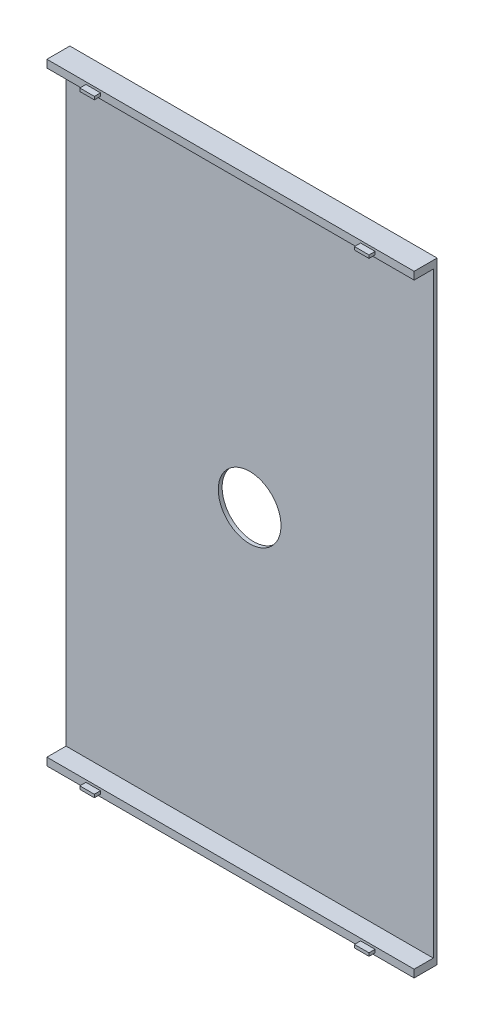
ISO-10303-21;
HEADER;
FILE_DESCRIPTION(('STEP AP214'),'2;1');
FILE_NAME('part.step','',(''),(''),'','','');
FILE_SCHEMA(('AUTOMOTIVE_DESIGN { 1 0 10303 214 1 1 1 1 }'));
ENDSEC;
DATA;
#1=APPLICATION_CONTEXT('core data for automotive mechanical design processes');
#2=APPLICATION_PROTOCOL_DEFINITION('international standard','automotive_design',2000,#1);
#3=PRODUCT_CONTEXT('',#1,'mechanical');
#4=PRODUCT('Part','Part','',(#3));
#5=PRODUCT_RELATED_PRODUCT_CATEGORY('part','',(#4));
#6=PRODUCT_DEFINITION_FORMATION('','',#4);
#7=PRODUCT_DEFINITION_CONTEXT('part definition',#1,'design');
#8=PRODUCT_DEFINITION('design','',#6,#7);
#9=PRODUCT_DEFINITION_SHAPE('','',#8);
#10=(LENGTH_UNIT() NAMED_UNIT(*) SI_UNIT(.MILLI.,.METRE.));
#11=(NAMED_UNIT(*) PLANE_ANGLE_UNIT() SI_UNIT($,.RADIAN.));
#12=(NAMED_UNIT(*) SI_UNIT($,.STERADIAN.) SOLID_ANGLE_UNIT());
#13=UNCERTAINTY_MEASURE_WITH_UNIT(LENGTH_MEASURE(1.E-05),#10,'distance_accuracy_value','');
#14=(GEOMETRIC_REPRESENTATION_CONTEXT(3) GLOBAL_UNCERTAINTY_ASSIGNED_CONTEXT((#13)) GLOBAL_UNIT_ASSIGNED_CONTEXT((#10,
#11,#12)) REPRESENTATION_CONTEXT('',''));
#15=CARTESIAN_POINT('',(0.,0.,0.));
#16=DIRECTION('',(0.,0.,1.));
#17=DIRECTION('',(1.,0.,0.));
#18=AXIS2_PLACEMENT_3D('',#15,#16,#17);
#19=CARTESIAN_POINT('',(0.,0.,3.));
#20=DIRECTION('',(0.,0.,1.));
#21=DIRECTION('',(1.,0.,0.));
#22=AXIS2_PLACEMENT_3D('',#19,#20,#21);
#23=PLANE('',#22);
#24=DIRECTION('',(0.,1.,0.));
#25=VECTOR('',#24,1.);
#26=CARTESIAN_POINT('',(48.,0.,3.));
#27=LINE('',#26,#25);
#28=CARTESIAN_POINT('',(48.,0.,3.));
#29=VERTEX_POINT('',#28);
#30=CARTESIAN_POINT('',(48.,1.,3.));
#31=VERTEX_POINT('',#30);
#32=EDGE_CURVE('E320',#29,#31,#27,.T.);
#33=ORIENTED_EDGE('',*,*,#32,.T.);
#34=DIRECTION('',(-1.,0.,0.));
#35=VECTOR('',#34,1.);
#36=CARTESIAN_POINT('',(48.,1.,3.));
#37=LINE('',#36,#35);
#38=CARTESIAN_POINT('',(0.,1.,3.));
#39=VERTEX_POINT('',#38);
#40=EDGE_CURVE('E323',#31,#39,#37,.T.);
#41=ORIENTED_EDGE('',*,*,#40,.T.);
#42=DIRECTION('',(0.,-1.,0.));
#43=VECTOR('',#42,1.);
#44=CARTESIAN_POINT('',(0.,1.,3.));
#45=LINE('',#44,#43);
#46=CARTESIAN_POINT('',(0.,0.,3.));
#47=VERTEX_POINT('',#46);
#48=EDGE_CURVE('E325',#39,#47,#45,.T.);
#49=ORIENTED_EDGE('',*,*,#48,.T.);
#50=DIRECTION('',(1.,0.,0.));
#51=VECTOR('',#50,1.);
#52=CARTESIAN_POINT('',(0.,0.,3.));
#53=LINE('',#52,#51);
#54=EDGE_CURVE('E328',#47,#29,#53,.T.);
#55=ORIENTED_EDGE('',*,*,#54,.T.);
#56=EDGE_LOOP('',(#33,#41,#49,#55));
#57=FACE_BOUND('',#56,.T.);
#58=DIRECTION('',(1.,0.,0.));
#59=VECTOR('',#58,1.);
#60=CARTESIAN_POINT('',(5.1,0.3,3.));
#61=LINE('',#60,#59);
#62=CARTESIAN_POINT('',(5.1,0.3,3.));
#63=VERTEX_POINT('',#62);
#64=CARTESIAN_POINT('',(7.,0.3,3.));
#65=VERTEX_POINT('',#64);
#66=EDGE_CURVE('E225',#63,#65,#61,.T.);
#67=ORIENTED_EDGE('',*,*,#66,.F.);
#68=DIRECTION('',(0.,-1.,0.));
#69=VECTOR('',#68,1.);
#70=CARTESIAN_POINT('',(5.1,0.700000000000002,3.));
#71=LINE('',#70,#69);
#72=CARTESIAN_POINT('',(5.1,0.700000000000002,3.));
#73=VERTEX_POINT('',#72);
#74=EDGE_CURVE('E222',#73,#63,#71,.T.);
#75=ORIENTED_EDGE('',*,*,#74,.F.);
#76=DIRECTION('',(-1.,0.,0.));
#77=VECTOR('',#76,1.);
#78=CARTESIAN_POINT('',(5.1,0.700000000000002,3.));
#79=LINE('',#78,#77);
#80=CARTESIAN_POINT('',(7.,0.700000000000003,3.));
#81=VERTEX_POINT('',#80);
#82=EDGE_CURVE('E234',#81,#73,#79,.T.);
#83=ORIENTED_EDGE('',*,*,#82,.F.);
#84=DIRECTION('',(0.,1.,0.));
#85=VECTOR('',#84,1.);
#86=CARTESIAN_POINT('',(7.,0.700000000000003,3.));
#87=LINE('',#86,#85);
#88=EDGE_CURVE('E242',#65,#81,#87,.T.);
#89=ORIENTED_EDGE('',*,*,#88,.F.);
#90=EDGE_LOOP('',(#67,#75,#83,#89));
#91=FACE_BOUND('',#90,.T.);
#92=DIRECTION('',(-1.,0.,0.));
#93=VECTOR('',#92,1.);
#94=CARTESIAN_POINT('',(42.9,0.700000000000011,3.));
#95=LINE('',#94,#93);
#96=CARTESIAN_POINT('',(42.9,0.700000000000011,3.));
#97=VERTEX_POINT('',#96);
#98=CARTESIAN_POINT('',(41.,0.700000000000019,3.));
#99=VERTEX_POINT('',#98);
#100=EDGE_CURVE('E728',#97,#99,#95,.T.);
#101=ORIENTED_EDGE('',*,*,#100,.F.);
#102=DIRECTION('',(0.,1.,0.));
#103=VECTOR('',#102,1.);
#104=CARTESIAN_POINT('',(42.9,0.700000000000011,3.));
#105=LINE('',#104,#103);
#106=CARTESIAN_POINT('',(42.9,0.300000000000005,3.));
#107=VERTEX_POINT('',#106);
#108=EDGE_CURVE('E220',#107,#97,#105,.T.);
#109=ORIENTED_EDGE('',*,*,#108,.F.);
#110=DIRECTION('',(1.,0.,0.));
#111=VECTOR('',#110,1.);
#112=CARTESIAN_POINT('',(42.9,0.300000000000005,3.));
#113=LINE('',#112,#111);
#114=CARTESIAN_POINT('',(41.,0.300000000000004,3.));
#115=VERTEX_POINT('',#114);
#116=EDGE_CURVE('E216',#115,#107,#113,.T.);
#117=ORIENTED_EDGE('',*,*,#116,.F.);
#118=DIRECTION('',(0.,-1.,0.));
#119=VECTOR('',#118,1.);
#120=CARTESIAN_POINT('',(41.,0.700000000000019,3.));
#121=LINE('',#120,#119);
#122=EDGE_CURVE('E730',#99,#115,#121,.T.);
#123=ORIENTED_EDGE('',*,*,#122,.F.);
#124=EDGE_LOOP('',(#101,#109,#117,#123));
#125=FACE_BOUND('',#124,.T.);
#126=ADVANCED_FACE('F35',(#57,#91,#125),#23,.T.);
#127=CARTESIAN_POINT('',(0.,0.,3.));
#128=DIRECTION('',(0.,0.,-1.));
#129=DIRECTION('',(-1.,0.,0.));
#130=AXIS2_PLACEMENT_3D('',#127,#128,#129);
#131=PLANE('',#130);
#132=DIRECTION('',(0.,-1.,0.));
#133=VECTOR('',#132,1.);
#134=CARTESIAN_POINT('',(5.1,79.7,3.));
#135=LINE('',#134,#133);
#136=CARTESIAN_POINT('',(5.1,79.7,3.));
#137=VERTEX_POINT('',#136);
#138=CARTESIAN_POINT('',(5.1,79.3,3.));
#139=VERTEX_POINT('',#138);
#140=EDGE_CURVE('E286',#137,#139,#135,.T.);
#141=ORIENTED_EDGE('',*,*,#140,.F.);
#142=DIRECTION('',(-1.,0.,0.));
#143=VECTOR('',#142,1.);
#144=CARTESIAN_POINT('',(5.1,79.7,3.));
#145=LINE('',#144,#143);
#146=CARTESIAN_POINT('',(7.,79.7,3.));
#147=VERTEX_POINT('',#146);
#148=EDGE_CURVE('E291',#147,#137,#145,.T.);
#149=ORIENTED_EDGE('',*,*,#148,.F.);
#150=DIRECTION('',(0.,1.,0.));
#151=VECTOR('',#150,1.);
#152=CARTESIAN_POINT('',(7.,79.7,3.));
#153=LINE('',#152,#151);
#154=CARTESIAN_POINT('',(7.,79.3,3.));
#155=VERTEX_POINT('',#154);
#156=EDGE_CURVE('E303',#155,#147,#153,.T.);
#157=ORIENTED_EDGE('',*,*,#156,.F.);
#158=DIRECTION('',(1.,0.,0.));
#159=VECTOR('',#158,1.);
#160=CARTESIAN_POINT('',(5.1,79.3,3.));
#161=LINE('',#160,#159);
#162=EDGE_CURVE('E300',#139,#155,#161,.T.);
#163=ORIENTED_EDGE('',*,*,#162,.F.);
#164=EDGE_LOOP('',(#141,#149,#157,#163));
#165=FACE_BOUND('',#164,.T.);
#166=DIRECTION('',(0.,-1.,0.));
#167=VECTOR('',#166,1.);
#168=CARTESIAN_POINT('',(0.,79.,3.));
#169=LINE('',#168,#167);
#170=CARTESIAN_POINT('',(0.,80.,3.));
#171=VERTEX_POINT('',#170);
#172=CARTESIAN_POINT('',(0.,79.,3.));
#173=VERTEX_POINT('',#172);
#174=EDGE_CURVE('E340',#171,#173,#169,.T.);
#175=ORIENTED_EDGE('',*,*,#174,.T.);
#176=DIRECTION('',(1.,0.,0.));
#177=VECTOR('',#176,1.);
#178=CARTESIAN_POINT('',(48.,79.,3.));
#179=LINE('',#178,#177);
#180=CARTESIAN_POINT('',(48.,79.,3.));
#181=VERTEX_POINT('',#180);
#182=EDGE_CURVE('E343',#173,#181,#179,.T.);
#183=ORIENTED_EDGE('',*,*,#182,.T.);
#184=DIRECTION('',(0.,1.,0.));
#185=VECTOR('',#184,1.);
#186=CARTESIAN_POINT('',(48.,80.,3.));
#187=LINE('',#186,#185);
#188=CARTESIAN_POINT('',(48.,80.,3.));
#189=VERTEX_POINT('',#188);
#190=EDGE_CURVE('E345',#181,#189,#187,.T.);
#191=ORIENTED_EDGE('',*,*,#190,.T.);
#192=DIRECTION('',(-1.,0.,0.));
#193=VECTOR('',#192,1.);
#194=CARTESIAN_POINT('',(0.,80.,3.));
#195=LINE('',#194,#193);
#196=EDGE_CURVE('E348',#189,#171,#195,.T.);
#197=ORIENTED_EDGE('',*,*,#196,.T.);
#198=EDGE_LOOP('',(#175,#183,#191,#197));
#199=FACE_BOUND('',#198,.T.);
#200=DIRECTION('',(0.,1.,0.));
#201=VECTOR('',#200,1.);
#202=CARTESIAN_POINT('',(42.9000000000001,79.7,3.));
#203=LINE('',#202,#201);
#204=CARTESIAN_POINT('',(42.9000000000001,79.3,3.));
#205=VERTEX_POINT('',#204);
#206=CARTESIAN_POINT('',(42.9000000000001,79.7,3.));
#207=VERTEX_POINT('',#206);
#208=EDGE_CURVE('E253',#205,#207,#203,.T.);
#209=ORIENTED_EDGE('',*,*,#208,.F.);
#210=DIRECTION('',(1.,0.,0.));
#211=VECTOR('',#210,1.);
#212=CARTESIAN_POINT('',(42.9000000000001,79.3,3.));
#213=LINE('',#212,#211);
#214=CARTESIAN_POINT('',(41.0000000000001,79.3,3.));
#215=VERTEX_POINT('',#214);
#216=EDGE_CURVE('E258',#215,#205,#213,.T.);
#217=ORIENTED_EDGE('',*,*,#216,.F.);
#218=DIRECTION('',(0.,-1.,0.));
#219=VECTOR('',#218,1.);
#220=CARTESIAN_POINT('',(41.0000000000001,79.7,3.));
#221=LINE('',#220,#219);
#222=CARTESIAN_POINT('',(41.0000000000001,79.7,3.));
#223=VERTEX_POINT('',#222);
#224=EDGE_CURVE('E270',#223,#215,#221,.T.);
#225=ORIENTED_EDGE('',*,*,#224,.F.);
#226=DIRECTION('',(-1.,0.,0.));
#227=VECTOR('',#226,1.);
#228=CARTESIAN_POINT('',(42.9000000000001,79.7,3.));
#229=LINE('',#228,#227);
#230=EDGE_CURVE('E267',#207,#223,#229,.T.);
#231=ORIENTED_EDGE('',*,*,#230,.F.);
#232=EDGE_LOOP('',(#209,#217,#225,#231));
#233=FACE_BOUND('',#232,.T.);
#234=ADVANCED_FACE('F397',(#165,#199,#233),#131,.F.);
#235=CARTESIAN_POINT('',(0.,0.,0.5));
#236=DIRECTION('',(0.,0.,1.));
#237=DIRECTION('',(1.,0.,0.));
#238=AXIS2_PLACEMENT_3D('',#235,#236,#237);
#239=PLANE('',#238);
#240=CARTESIAN_POINT('',(24.,40.,0.5));
#241=DIRECTION('',(0.,0.,-1.));
#242=DIRECTION('',(-1.,0.,0.));
#243=AXIS2_PLACEMENT_3D('',#240,#241,#242);
#244=CIRCLE('',#243,4.1);
#245=CARTESIAN_POINT('',(19.9,40.,0.5));
#246=VERTEX_POINT('',#245);
#247=EDGE_CURVE('E717',#246,#246,#244,.T.);
#248=ORIENTED_EDGE('',*,*,#247,.T.);
#249=EDGE_LOOP('',(#248));
#250=FACE_BOUND('',#249,.T.);
#251=DIRECTION('',(0.,-1.,0.));
#252=VECTOR('',#251,1.);
#253=CARTESIAN_POINT('',(0.,80.,0.5));
#254=LINE('',#253,#252);
#255=CARTESIAN_POINT('',(0.,79.,0.5));
#256=VERTEX_POINT('',#255);
#257=CARTESIAN_POINT('',(0.,1.,0.5));
#258=VERTEX_POINT('',#257);
#259=EDGE_CURVE('E360',#256,#258,#254,.T.);
#260=ORIENTED_EDGE('',*,*,#259,.T.);
#261=DIRECTION('',(-1.,0.,0.));
#262=VECTOR('',#261,1.);
#263=CARTESIAN_POINT('',(48.,1.,0.5));
#264=LINE('',#263,#262);
#265=CARTESIAN_POINT('',(48.,1.,0.5));
#266=VERTEX_POINT('',#265);
#267=EDGE_CURVE('E319',#266,#258,#264,.T.);
#268=ORIENTED_EDGE('',*,*,#267,.F.);
#269=DIRECTION('',(0.,1.,0.));
#270=VECTOR('',#269,1.);
#271=CARTESIAN_POINT('',(48.,0.,0.5));
#272=LINE('',#271,#270);
#273=CARTESIAN_POINT('',(48.,79.,0.5));
#274=VERTEX_POINT('',#273);
#275=EDGE_CURVE('E362',#266,#274,#272,.T.);
#276=ORIENTED_EDGE('',*,*,#275,.T.);
#277=DIRECTION('',(1.,0.,0.));
#278=VECTOR('',#277,1.);
#279=CARTESIAN_POINT('',(48.,79.,0.5));
#280=LINE('',#279,#278);
#281=EDGE_CURVE('E339',#256,#274,#280,.T.);
#282=ORIENTED_EDGE('',*,*,#281,.F.);
#283=EDGE_LOOP('',(#260,#268,#276,#282));
#284=FACE_BOUND('',#283,.T.);
#285=ADVANCED_FACE('F405',(#250,#284),#239,.T.);
#286=CARTESIAN_POINT('',(0.,80.,0.5));
#287=DIRECTION('',(1.,0.,0.));
#288=DIRECTION('',(0.,1.,0.));
#289=AXIS2_PLACEMENT_3D('',#286,#287,#288);
#290=PLANE('',#289);
#291=DIRECTION('',(0.,-1.,0.));
#292=VECTOR('',#291,1.);
#293=CARTESIAN_POINT('',(0.,80.,0.));
#294=LINE('',#293,#292);
#295=CARTESIAN_POINT('',(0.,80.,0.));
#296=VERTEX_POINT('',#295);
#297=CARTESIAN_POINT('',(0.,0.,0.));
#298=VERTEX_POINT('',#297);
#299=EDGE_CURVE('E359',#296,#298,#294,.T.);
#300=ORIENTED_EDGE('',*,*,#299,.T.);
#301=DIRECTION('',(0.,0.,-1.));
#302=VECTOR('',#301,1.);
#303=CARTESIAN_POINT('',(0.,0.,0.5));
#304=LINE('',#303,#302);
#305=EDGE_CURVE('E11',#47,#298,#304,.T.);
#306=ORIENTED_EDGE('',*,*,#305,.F.);
#307=ORIENTED_EDGE('',*,*,#48,.F.);
#308=DIRECTION('',(0.,0.,-1.));
#309=VECTOR('',#308,1.);
#310=CARTESIAN_POINT('',(0.,1.,3.));
#311=LINE('',#310,#309);
#312=EDGE_CURVE('E331',#39,#258,#311,.T.);
#313=ORIENTED_EDGE('',*,*,#312,.T.);
#314=ORIENTED_EDGE('',*,*,#259,.F.);
#315=DIRECTION('',(0.,0.,-1.));
#316=VECTOR('',#315,1.);
#317=CARTESIAN_POINT('',(0.,79.,3.));
#318=LINE('',#317,#316);
#319=EDGE_CURVE('E356',#173,#256,#318,.T.);
#320=ORIENTED_EDGE('',*,*,#319,.F.);
#321=ORIENTED_EDGE('',*,*,#174,.F.);
#322=DIRECTION('',(0.,0.,-1.));
#323=VECTOR('',#322,1.);
#324=CARTESIAN_POINT('',(0.,80.,0.5));
#325=LINE('',#324,#323);
#326=EDGE_CURVE('E365',#171,#296,#325,.T.);
#327=ORIENTED_EDGE('',*,*,#326,.T.);
#328=EDGE_LOOP('',(#300,#306,#307,#313,#314,#320,#321,#327));
#329=FACE_BOUND('',#328,.T.);
#330=ADVANCED_FACE('F37',(#329),#290,.F.);
#331=CARTESIAN_POINT('',(0.,0.,0.5));
#332=DIRECTION('',(0.,1.,0.));
#333=DIRECTION('',(0.,0.,1.));
#334=AXIS2_PLACEMENT_3D('',#331,#332,#333);
#335=PLANE('',#334);
#336=DIRECTION('',(1.,0.,0.));
#337=VECTOR('',#336,1.);
#338=CARTESIAN_POINT('',(0.,0.,0.));
#339=LINE('',#338,#337);
#340=CARTESIAN_POINT('',(48.,0.,0.));
#341=VERTEX_POINT('',#340);
#342=EDGE_CURVE('E368',#298,#341,#339,.T.);
#343=ORIENTED_EDGE('',*,*,#342,.T.);
#344=DIRECTION('',(0.,0.,-1.));
#345=VECTOR('',#344,1.);
#346=CARTESIAN_POINT('',(48.,0.,0.5));
#347=LINE('',#346,#345);
#348=EDGE_CURVE('E43',#29,#341,#347,.T.);
#349=ORIENTED_EDGE('',*,*,#348,.F.);
#350=ORIENTED_EDGE('',*,*,#54,.F.);
#351=ORIENTED_EDGE('',*,*,#305,.T.);
#352=EDGE_LOOP('',(#343,#349,#350,#351));
#353=FACE_BOUND('',#352,.T.);
#354=ADVANCED_FACE('F412',(#353),#335,.F.);
#355=CARTESIAN_POINT('',(48.,0.,0.5));
#356=DIRECTION('',(-1.,0.,0.));
#357=DIRECTION('',(0.,0.,1.));
#358=AXIS2_PLACEMENT_3D('',#355,#356,#357);
#359=PLANE('',#358);
#360=DIRECTION('',(0.,1.,0.));
#361=VECTOR('',#360,1.);
#362=CARTESIAN_POINT('',(48.,0.,0.));
#363=LINE('',#362,#361);
#364=CARTESIAN_POINT('',(48.,80.,0.));
#365=VERTEX_POINT('',#364);
#366=EDGE_CURVE('E370',#341,#365,#363,.T.);
#367=ORIENTED_EDGE('',*,*,#366,.T.);
#368=DIRECTION('',(0.,0.,-1.));
#369=VECTOR('',#368,1.);
#370=CARTESIAN_POINT('',(48.,80.,0.5));
#371=LINE('',#370,#369);
#372=EDGE_CURVE('E375',#189,#365,#371,.T.);
#373=ORIENTED_EDGE('',*,*,#372,.F.);
#374=ORIENTED_EDGE('',*,*,#190,.F.);
#375=DIRECTION('',(0.,0.,-1.));
#376=VECTOR('',#375,1.);
#377=CARTESIAN_POINT('',(48.,79.,3.));
#378=LINE('',#377,#376);
#379=EDGE_CURVE('E351',#181,#274,#378,.T.);
#380=ORIENTED_EDGE('',*,*,#379,.T.);
#381=ORIENTED_EDGE('',*,*,#275,.F.);
#382=DIRECTION('',(0.,0.,-1.));
#383=VECTOR('',#382,1.);
#384=CARTESIAN_POINT('',(48.,1.,3.));
#385=LINE('',#384,#383);
#386=EDGE_CURVE('E336',#31,#266,#385,.T.);
#387=ORIENTED_EDGE('',*,*,#386,.F.);
#388=ORIENTED_EDGE('',*,*,#32,.F.);
#389=ORIENTED_EDGE('',*,*,#348,.T.);
#390=EDGE_LOOP('',(#367,#373,#374,#380,#381,#387,#388,#389));
#391=FACE_BOUND('',#390,.T.);
#392=ADVANCED_FACE('F381',(#391),#359,.F.);
#393=CARTESIAN_POINT('',(48.,80.,0.5));
#394=DIRECTION('',(0.,-1.,0.));
#395=DIRECTION('',(1.,0.,0.));
#396=AXIS2_PLACEMENT_3D('',#393,#394,#395);
#397=PLANE('',#396);
#398=DIRECTION('',(-1.,0.,0.));
#399=VECTOR('',#398,1.);
#400=CARTESIAN_POINT('',(48.,80.,0.));
#401=LINE('',#400,#399);
#402=EDGE_CURVE('E363',#365,#296,#401,.T.);
#403=ORIENTED_EDGE('',*,*,#402,.T.);
#404=ORIENTED_EDGE('',*,*,#326,.F.);
#405=ORIENTED_EDGE('',*,*,#196,.F.);
#406=ORIENTED_EDGE('',*,*,#372,.T.);
#407=EDGE_LOOP('',(#403,#404,#405,#406));
#408=FACE_BOUND('',#407,.T.);
#409=ADVANCED_FACE('F390',(#408),#397,.F.);
#410=CARTESIAN_POINT('',(0.,0.,0.));
#411=DIRECTION('',(0.,0.,1.));
#412=DIRECTION('',(1.,0.,0.));
#413=AXIS2_PLACEMENT_3D('',#410,#411,#412);
#414=PLANE('',#413);
#415=CARTESIAN_POINT('',(24.,40.,0.));
#416=DIRECTION('',(0.,0.,-1.));
#417=DIRECTION('',(-1.,0.,0.));
#418=AXIS2_PLACEMENT_3D('',#415,#416,#417);
#419=CIRCLE('',#418,4.1);
#420=CARTESIAN_POINT('',(19.9,40.,0.));
#421=VERTEX_POINT('',#420);
#422=EDGE_CURVE('E720',#421,#421,#419,.T.);
#423=ORIENTED_EDGE('',*,*,#422,.F.);
#424=EDGE_LOOP('',(#423));
#425=FACE_BOUND('',#424,.T.);
#426=ORIENTED_EDGE('',*,*,#299,.F.);
#427=ORIENTED_EDGE('',*,*,#402,.F.);
#428=ORIENTED_EDGE('',*,*,#366,.F.);
#429=ORIENTED_EDGE('',*,*,#342,.F.);
#430=EDGE_LOOP('',(#426,#427,#428,#429));
#431=FACE_BOUND('',#430,.T.);
#432=ADVANCED_FACE('F388',(#425,#431),#414,.F.);
#433=CARTESIAN_POINT('',(48.,79.,3.));
#434=DIRECTION('',(0.,1.,0.));
#435=DIRECTION('',(0.,0.,1.));
#436=AXIS2_PLACEMENT_3D('',#433,#434,#435);
#437=PLANE('',#436);
#438=ORIENTED_EDGE('',*,*,#281,.T.);
#439=ORIENTED_EDGE('',*,*,#379,.F.);
#440=ORIENTED_EDGE('',*,*,#182,.F.);
#441=ORIENTED_EDGE('',*,*,#319,.T.);
#442=EDGE_LOOP('',(#438,#439,#440,#441));
#443=FACE_BOUND('',#442,.T.);
#444=ADVANCED_FACE('F403',(#443),#437,.F.);
#445=CARTESIAN_POINT('',(48.,1.,3.));
#446=DIRECTION('',(0.,-1.,0.));
#447=DIRECTION('',(0.,0.,-1.));
#448=AXIS2_PLACEMENT_3D('',#445,#446,#447);
#449=PLANE('',#448);
#450=ORIENTED_EDGE('',*,*,#267,.T.);
#451=ORIENTED_EDGE('',*,*,#312,.F.);
#452=ORIENTED_EDGE('',*,*,#40,.F.);
#453=ORIENTED_EDGE('',*,*,#386,.T.);
#454=EDGE_LOOP('',(#450,#451,#452,#453));
#455=FACE_BOUND('',#454,.T.);
#456=ADVANCED_FACE('F409',(#455),#449,.F.);
#457=CARTESIAN_POINT('',(5.1,79.7,3.8));
#458=DIRECTION('',(1.,0.,0.));
#459=DIRECTION('',(0.,0.,-1.));
#460=AXIS2_PLACEMENT_3D('',#457,#458,#459);
#461=PLANE('',#460);
#462=ORIENTED_EDGE('',*,*,#140,.T.);
#463=DIRECTION('',(0.,0.,-1.));
#464=VECTOR('',#463,1.);
#465=CARTESIAN_POINT('',(5.1,79.3,3.8));
#466=LINE('',#465,#464);
#467=CARTESIAN_POINT('',(5.1,79.3,3.8));
#468=VERTEX_POINT('',#467);
#469=EDGE_CURVE('E316',#468,#139,#466,.T.);
#470=ORIENTED_EDGE('',*,*,#469,.F.);
#471=DIRECTION('',(0.,-1.,0.));
#472=VECTOR('',#471,1.);
#473=CARTESIAN_POINT('',(5.1,79.7,3.8));
#474=LINE('',#473,#472);
#475=CARTESIAN_POINT('',(5.1,79.7,3.8));
#476=VERTEX_POINT('',#475);
#477=EDGE_CURVE('E287',#476,#468,#474,.T.);
#478=ORIENTED_EDGE('',*,*,#477,.F.);
#479=DIRECTION('',(0.,0.,-1.));
#480=VECTOR('',#479,1.);
#481=CARTESIAN_POINT('',(5.1,79.7,3.8));
#482=LINE('',#481,#480);
#483=EDGE_CURVE('E297',#476,#137,#482,.T.);
#484=ORIENTED_EDGE('',*,*,#483,.T.);
#485=EDGE_LOOP('',(#462,#470,#478,#484));
#486=FACE_BOUND('',#485,.T.);
#487=ADVANCED_FACE('F428',(#486),#461,.F.);
#488=CARTESIAN_POINT('',(5.1,79.3,3.8));
#489=DIRECTION('',(0.,1.,0.));
#490=DIRECTION('',(0.,0.,1.));
#491=AXIS2_PLACEMENT_3D('',#488,#489,#490);
#492=PLANE('',#491);
#493=ORIENTED_EDGE('',*,*,#162,.T.);
#494=DIRECTION('',(0.,0.,-1.));
#495=VECTOR('',#494,1.);
#496=CARTESIAN_POINT('',(7.,79.3,3.8));
#497=LINE('',#496,#495);
#498=CARTESIAN_POINT('',(7.,79.3,3.8));
#499=VERTEX_POINT('',#498);
#500=EDGE_CURVE('E313',#499,#155,#497,.T.);
#501=ORIENTED_EDGE('',*,*,#500,.F.);
#502=DIRECTION('',(1.,0.,0.));
#503=VECTOR('',#502,1.);
#504=CARTESIAN_POINT('',(5.1,79.3,3.8));
#505=LINE('',#504,#503);
#506=EDGE_CURVE('E290',#468,#499,#505,.T.);
#507=ORIENTED_EDGE('',*,*,#506,.F.);
#508=ORIENTED_EDGE('',*,*,#469,.T.);
#509=EDGE_LOOP('',(#493,#501,#507,#508));
#510=FACE_BOUND('',#509,.T.);
#511=ADVANCED_FACE('F466',(#510),#492,.F.);
#512=CARTESIAN_POINT('',(7.,79.7,3.8));
#513=DIRECTION('',(-1.,0.,0.));
#514=DIRECTION('',(0.,-1.,0.));
#515=AXIS2_PLACEMENT_3D('',#512,#513,#514);
#516=PLANE('',#515);
#517=ORIENTED_EDGE('',*,*,#156,.T.);
#518=DIRECTION('',(0.,0.,-1.));
#519=VECTOR('',#518,1.);
#520=CARTESIAN_POINT('',(7.,79.7,3.8));
#521=LINE('',#520,#519);
#522=CARTESIAN_POINT('',(7.,79.7,3.8));
#523=VERTEX_POINT('',#522);
#524=EDGE_CURVE('E310',#523,#147,#521,.T.);
#525=ORIENTED_EDGE('',*,*,#524,.F.);
#526=DIRECTION('',(0.,1.,0.));
#527=VECTOR('',#526,1.);
#528=CARTESIAN_POINT('',(7.,79.7,3.8));
#529=LINE('',#528,#527);
#530=EDGE_CURVE('E293',#499,#523,#529,.T.);
#531=ORIENTED_EDGE('',*,*,#530,.F.);
#532=ORIENTED_EDGE('',*,*,#500,.T.);
#533=EDGE_LOOP('',(#517,#525,#531,#532));
#534=FACE_BOUND('',#533,.T.);
#535=ADVANCED_FACE('F473',(#534),#516,.F.);
#536=CARTESIAN_POINT('',(5.1,79.7,3.8));
#537=DIRECTION('',(0.,-1.,0.));
#538=DIRECTION('',(0.,0.,-1.));
#539=AXIS2_PLACEMENT_3D('',#536,#537,#538);
#540=PLANE('',#539);
#541=ORIENTED_EDGE('',*,*,#148,.T.);
#542=ORIENTED_EDGE('',*,*,#483,.F.);
#543=DIRECTION('',(-1.,0.,0.));
#544=VECTOR('',#543,1.);
#545=CARTESIAN_POINT('',(5.1,79.7,3.8));
#546=LINE('',#545,#544);
#547=EDGE_CURVE('E295',#523,#476,#546,.T.);
#548=ORIENTED_EDGE('',*,*,#547,.F.);
#549=ORIENTED_EDGE('',*,*,#524,.T.);
#550=EDGE_LOOP('',(#541,#542,#548,#549));
#551=FACE_BOUND('',#550,.T.);
#552=ADVANCED_FACE('F480',(#551),#540,.F.);
#553=CARTESIAN_POINT('',(0.,0.,3.8));
#554=DIRECTION('',(0.,0.,1.));
#555=DIRECTION('',(1.,0.,0.));
#556=AXIS2_PLACEMENT_3D('',#553,#554,#555);
#557=PLANE('',#556);
#558=ORIENTED_EDGE('',*,*,#477,.T.);
#559=ORIENTED_EDGE('',*,*,#506,.T.);
#560=ORIENTED_EDGE('',*,*,#530,.T.);
#561=ORIENTED_EDGE('',*,*,#547,.T.);
#562=EDGE_LOOP('',(#558,#559,#560,#561));
#563=FACE_BOUND('',#562,.T.);
#564=ADVANCED_FACE('F488',(#563),#557,.T.);
#565=CARTESIAN_POINT('',(42.9000000000001,79.7,3.8));
#566=DIRECTION('',(-1.,0.,0.));
#567=DIRECTION('',(0.,0.,1.));
#568=AXIS2_PLACEMENT_3D('',#565,#566,#567);
#569=PLANE('',#568);
#570=ORIENTED_EDGE('',*,*,#208,.T.);
#571=DIRECTION('',(0.,0.,-1.));
#572=VECTOR('',#571,1.);
#573=CARTESIAN_POINT('',(42.9000000000001,79.7,3.8));
#574=LINE('',#573,#572);
#575=CARTESIAN_POINT('',(42.9000000000001,79.7,3.8));
#576=VERTEX_POINT('',#575);
#577=EDGE_CURVE('E283',#576,#207,#574,.T.);
#578=ORIENTED_EDGE('',*,*,#577,.F.);
#579=DIRECTION('',(0.,1.,0.));
#580=VECTOR('',#579,1.);
#581=CARTESIAN_POINT('',(42.9000000000001,79.7,3.8));
#582=LINE('',#581,#580);
#583=CARTESIAN_POINT('',(42.9000000000001,79.3,3.8));
#584=VERTEX_POINT('',#583);
#585=EDGE_CURVE('E254',#584,#576,#582,.T.);
#586=ORIENTED_EDGE('',*,*,#585,.F.);
#587=DIRECTION('',(0.,0.,-1.));
#588=VECTOR('',#587,1.);
#589=CARTESIAN_POINT('',(42.9000000000001,79.3,3.8));
#590=LINE('',#589,#588);
#591=EDGE_CURVE('E264',#584,#205,#590,.T.);
#592=ORIENTED_EDGE('',*,*,#591,.T.);
#593=EDGE_LOOP('',(#570,#578,#586,#592));
#594=FACE_BOUND('',#593,.T.);
#595=ADVANCED_FACE('F496',(#594),#569,.F.);
#596=CARTESIAN_POINT('',(42.9000000000001,79.7,3.8));
#597=DIRECTION('',(0.,-1.,0.));
#598=DIRECTION('',(0.,0.,-1.));
#599=AXIS2_PLACEMENT_3D('',#596,#597,#598);
#600=PLANE('',#599);
#601=ORIENTED_EDGE('',*,*,#230,.T.);
#602=DIRECTION('',(0.,0.,-1.));
#603=VECTOR('',#602,1.);
#604=CARTESIAN_POINT('',(41.0000000000001,79.7,3.8));
#605=LINE('',#604,#603);
#606=CARTESIAN_POINT('',(41.0000000000001,79.7,3.8));
#607=VERTEX_POINT('',#606);
#608=EDGE_CURVE('E280',#607,#223,#605,.T.);
#609=ORIENTED_EDGE('',*,*,#608,.F.);
#610=DIRECTION('',(-1.,0.,0.));
#611=VECTOR('',#610,1.);
#612=CARTESIAN_POINT('',(42.9000000000001,79.7,3.8));
#613=LINE('',#612,#611);
#614=EDGE_CURVE('E257',#576,#607,#613,.T.);
#615=ORIENTED_EDGE('',*,*,#614,.F.);
#616=ORIENTED_EDGE('',*,*,#577,.T.);
#617=EDGE_LOOP('',(#601,#609,#615,#616));
#618=FACE_BOUND('',#617,.T.);
#619=ADVANCED_FACE('F504',(#618),#600,.F.);
#620=CARTESIAN_POINT('',(41.0000000000001,79.7,3.8));
#621=DIRECTION('',(1.,0.,0.));
#622=DIRECTION('',(0.,0.,-1.));
#623=AXIS2_PLACEMENT_3D('',#620,#621,#622);
#624=PLANE('',#623);
#625=ORIENTED_EDGE('',*,*,#224,.T.);
#626=DIRECTION('',(0.,0.,-1.));
#627=VECTOR('',#626,1.);
#628=CARTESIAN_POINT('',(41.0000000000001,79.3,3.8));
#629=LINE('',#628,#627);
#630=CARTESIAN_POINT('',(41.0000000000001,79.3,3.8));
#631=VERTEX_POINT('',#630);
#632=EDGE_CURVE('E277',#631,#215,#629,.T.);
#633=ORIENTED_EDGE('',*,*,#632,.F.);
#634=DIRECTION('',(0.,-1.,0.));
#635=VECTOR('',#634,1.);
#636=CARTESIAN_POINT('',(41.0000000000001,79.7,3.8));
#637=LINE('',#636,#635);
#638=EDGE_CURVE('E260',#607,#631,#637,.T.);
#639=ORIENTED_EDGE('',*,*,#638,.F.);
#640=ORIENTED_EDGE('',*,*,#608,.T.);
#641=EDGE_LOOP('',(#625,#633,#639,#640));
#642=FACE_BOUND('',#641,.T.);
#643=ADVANCED_FACE('F512',(#642),#624,.F.);
#644=CARTESIAN_POINT('',(42.9000000000001,79.3,3.8));
#645=DIRECTION('',(0.,1.,0.));
#646=DIRECTION('',(0.,0.,1.));
#647=AXIS2_PLACEMENT_3D('',#644,#645,#646);
#648=PLANE('',#647);
#649=ORIENTED_EDGE('',*,*,#216,.T.);
#650=ORIENTED_EDGE('',*,*,#591,.F.);
#651=DIRECTION('',(1.,0.,0.));
#652=VECTOR('',#651,1.);
#653=CARTESIAN_POINT('',(42.9000000000001,79.3,3.8));
#654=LINE('',#653,#652);
#655=EDGE_CURVE('E262',#631,#584,#654,.T.);
#656=ORIENTED_EDGE('',*,*,#655,.F.);
#657=ORIENTED_EDGE('',*,*,#632,.T.);
#658=EDGE_LOOP('',(#649,#650,#656,#657));
#659=FACE_BOUND('',#658,.T.);
#660=ADVANCED_FACE('F520',(#659),#648,.F.);
#661=CARTESIAN_POINT('',(0.,0.,3.8));
#662=DIRECTION('',(0.,0.,-1.));
#663=DIRECTION('',(-1.,0.,0.));
#664=AXIS2_PLACEMENT_3D('',#661,#662,#663);
#665=PLANE('',#664);
#666=ORIENTED_EDGE('',*,*,#585,.T.);
#667=ORIENTED_EDGE('',*,*,#614,.T.);
#668=ORIENTED_EDGE('',*,*,#638,.T.);
#669=ORIENTED_EDGE('',*,*,#655,.T.);
#670=EDGE_LOOP('',(#666,#667,#668,#669));
#671=FACE_BOUND('',#670,.T.);
#672=ADVANCED_FACE('F528',(#671),#665,.F.);
#673=CARTESIAN_POINT('',(5.1,0.700000000000002,3.8));
#674=DIRECTION('',(1.,0.,0.));
#675=DIRECTION('',(0.,0.,-1.));
#676=AXIS2_PLACEMENT_3D('',#673,#674,#675);
#677=PLANE('',#676);
#678=ORIENTED_EDGE('',*,*,#74,.T.);
#679=DIRECTION('',(0.,0.,-1.));
#680=VECTOR('',#679,1.);
#681=CARTESIAN_POINT('',(5.1,0.3,3.8));
#682=LINE('',#681,#680);
#683=CARTESIAN_POINT('',(5.1,0.3,3.8));
#684=VERTEX_POINT('',#683);
#685=EDGE_CURVE('E251',#684,#63,#682,.T.);
#686=ORIENTED_EDGE('',*,*,#685,.F.);
#687=DIRECTION('',(0.,-1.,0.));
#688=VECTOR('',#687,1.);
#689=CARTESIAN_POINT('',(5.1,0.700000000000002,3.8));
#690=LINE('',#689,#688);
#691=CARTESIAN_POINT('',(5.1,0.700000000000002,3.8));
#692=VERTEX_POINT('',#691);
#693=EDGE_CURVE('E230',#692,#684,#690,.T.);
#694=ORIENTED_EDGE('',*,*,#693,.F.);
#695=DIRECTION('',(0.,0.,-1.));
#696=VECTOR('',#695,1.);
#697=CARTESIAN_POINT('',(5.1,0.700000000000002,3.8));
#698=LINE('',#697,#696);
#699=EDGE_CURVE('E239',#692,#73,#698,.T.);
#700=ORIENTED_EDGE('',*,*,#699,.T.);
#701=EDGE_LOOP('',(#678,#686,#694,#700));
#702=FACE_BOUND('',#701,.T.);
#703=ADVANCED_FACE('F536',(#702),#677,.F.);
#704=CARTESIAN_POINT('',(5.1,0.3,3.8));
#705=DIRECTION('',(0.,1.,0.));
#706=DIRECTION('',(-1.,0.,0.));
#707=AXIS2_PLACEMENT_3D('',#704,#705,#706);
#708=PLANE('',#707);
#709=ORIENTED_EDGE('',*,*,#66,.T.);
#710=DIRECTION('',(0.,0.,-1.));
#711=VECTOR('',#710,1.);
#712=CARTESIAN_POINT('',(7.,0.3,3.8));
#713=LINE('',#712,#711);
#714=CARTESIAN_POINT('',(7.,0.3,3.8));
#715=VERTEX_POINT('',#714);
#716=EDGE_CURVE('E248',#715,#65,#713,.T.);
#717=ORIENTED_EDGE('',*,*,#716,.F.);
#718=DIRECTION('',(1.,0.,0.));
#719=VECTOR('',#718,1.);
#720=CARTESIAN_POINT('',(5.1,0.3,3.8));
#721=LINE('',#720,#719);
#722=EDGE_CURVE('E233',#684,#715,#721,.T.);
#723=ORIENTED_EDGE('',*,*,#722,.F.);
#724=ORIENTED_EDGE('',*,*,#685,.T.);
#725=EDGE_LOOP('',(#709,#717,#723,#724));
#726=FACE_BOUND('',#725,.T.);
#727=ADVANCED_FACE('F544',(#726),#708,.F.);
#728=CARTESIAN_POINT('',(7.,0.700000000000003,3.8));
#729=DIRECTION('',(-1.,0.,0.));
#730=DIRECTION('',(0.,0.,1.));
#731=AXIS2_PLACEMENT_3D('',#728,#729,#730);
#732=PLANE('',#731);
#733=ORIENTED_EDGE('',*,*,#88,.T.);
#734=DIRECTION('',(0.,0.,-1.));
#735=VECTOR('',#734,1.);
#736=CARTESIAN_POINT('',(7.,0.700000000000003,3.8));
#737=LINE('',#736,#735);
#738=CARTESIAN_POINT('',(7.,0.700000000000003,3.8));
#739=VERTEX_POINT('',#738);
#740=EDGE_CURVE('E58',#739,#81,#737,.T.);
#741=ORIENTED_EDGE('',*,*,#740,.F.);
#742=DIRECTION('',(0.,1.,0.));
#743=VECTOR('',#742,1.);
#744=CARTESIAN_POINT('',(7.,0.700000000000003,3.8));
#745=LINE('',#744,#743);
#746=EDGE_CURVE('E236',#715,#739,#745,.T.);
#747=ORIENTED_EDGE('',*,*,#746,.F.);
#748=ORIENTED_EDGE('',*,*,#716,.T.);
#749=EDGE_LOOP('',(#733,#741,#747,#748));
#750=FACE_BOUND('',#749,.T.);
#751=ADVANCED_FACE('F552',(#750),#732,.F.);
#752=CARTESIAN_POINT('',(5.1,0.700000000000002,3.8));
#753=DIRECTION('',(0.,-1.,0.));
#754=DIRECTION('',(1.,0.,0.));
#755=AXIS2_PLACEMENT_3D('',#752,#753,#754);
#756=PLANE('',#755);
#757=ORIENTED_EDGE('',*,*,#82,.T.);
#758=ORIENTED_EDGE('',*,*,#699,.F.);
#759=DIRECTION('',(-1.,0.,0.));
#760=VECTOR('',#759,1.);
#761=CARTESIAN_POINT('',(5.1,0.700000000000002,3.8));
#762=LINE('',#761,#760);
#763=EDGE_CURVE('E238',#739,#692,#762,.T.);
#764=ORIENTED_EDGE('',*,*,#763,.F.);
#765=ORIENTED_EDGE('',*,*,#740,.T.);
#766=EDGE_LOOP('',(#757,#758,#764,#765));
#767=FACE_BOUND('',#766,.T.);
#768=ADVANCED_FACE('F560',(#767),#756,.F.);
#769=CARTESIAN_POINT('',(0.,0.,3.8));
#770=DIRECTION('',(0.,0.,1.));
#771=DIRECTION('',(1.,0.,0.));
#772=AXIS2_PLACEMENT_3D('',#769,#770,#771);
#773=PLANE('',#772);
#774=ORIENTED_EDGE('',*,*,#693,.T.);
#775=ORIENTED_EDGE('',*,*,#722,.T.);
#776=ORIENTED_EDGE('',*,*,#746,.T.);
#777=ORIENTED_EDGE('',*,*,#763,.T.);
#778=EDGE_LOOP('',(#774,#775,#776,#777));
#779=FACE_BOUND('',#778,.T.);
#780=ADVANCED_FACE('F568',(#779),#773,.T.);
#781=CARTESIAN_POINT('',(42.9,0.700000000000011,3.8));
#782=DIRECTION('',(-1.,0.,0.));
#783=DIRECTION('',(0.,0.,1.));
#784=AXIS2_PLACEMENT_3D('',#781,#782,#783);
#785=PLANE('',#784);
#786=ORIENTED_EDGE('',*,*,#108,.T.);
#787=DIRECTION('',(0.,0.,-1.));
#788=VECTOR('',#787,1.);
#789=CARTESIAN_POINT('',(42.9,0.700000000000011,3.8));
#790=LINE('',#789,#788);
#791=CARTESIAN_POINT('',(42.9,0.700000000000011,3.8));
#792=VERTEX_POINT('',#791);
#793=EDGE_CURVE('E201',#792,#97,#790,.T.);
#794=ORIENTED_EDGE('',*,*,#793,.F.);
#795=DIRECTION('',(0.,1.,0.));
#796=VECTOR('',#795,1.);
#797=CARTESIAN_POINT('',(42.9,0.700000000000011,3.8));
#798=LINE('',#797,#796);
#799=CARTESIAN_POINT('',(42.9,0.300000000000005,3.8));
#800=VERTEX_POINT('',#799);
#801=EDGE_CURVE('E208',#800,#792,#798,.T.);
#802=ORIENTED_EDGE('',*,*,#801,.F.);
#803=DIRECTION('',(0.,0.,-1.));
#804=VECTOR('',#803,1.);
#805=CARTESIAN_POINT('',(42.9,0.300000000000005,3.8));
#806=LINE('',#805,#804);
#807=EDGE_CURVE('E726',#800,#107,#806,.T.);
#808=ORIENTED_EDGE('',*,*,#807,.T.);
#809=EDGE_LOOP('',(#786,#794,#802,#808));
#810=FACE_BOUND('',#809,.T.);
#811=ADVANCED_FACE('F218',(#810),#785,.F.);
#812=CARTESIAN_POINT('',(42.9,0.700000000000011,3.8));
#813=DIRECTION('',(0.,-1.,0.));
#814=DIRECTION('',(1.,0.,0.));
#815=AXIS2_PLACEMENT_3D('',#812,#813,#814);
#816=PLANE('',#815);
#817=ORIENTED_EDGE('',*,*,#100,.T.);
#818=DIRECTION('',(0.,0.,-1.));
#819=VECTOR('',#818,1.);
#820=CARTESIAN_POINT('',(41.,0.700000000000019,3.8));
#821=LINE('',#820,#819);
#822=CARTESIAN_POINT('',(41.,0.700000000000019,3.8));
#823=VERTEX_POINT('',#822);
#824=EDGE_CURVE('E204',#823,#99,#821,.T.);
#825=ORIENTED_EDGE('',*,*,#824,.F.);
#826=DIRECTION('',(-1.,0.,0.));
#827=VECTOR('',#826,1.);
#828=CARTESIAN_POINT('',(42.9,0.700000000000011,3.8));
#829=LINE('',#828,#827);
#830=EDGE_CURVE('E197',#792,#823,#829,.T.);
#831=ORIENTED_EDGE('',*,*,#830,.F.);
#832=ORIENTED_EDGE('',*,*,#793,.T.);
#833=EDGE_LOOP('',(#817,#825,#831,#832));
#834=FACE_BOUND('',#833,.T.);
#835=ADVANCED_FACE('F199',(#834),#816,.F.);
#836=CARTESIAN_POINT('',(41.,0.700000000000019,3.8));
#837=DIRECTION('',(1.,0.,0.));
#838=DIRECTION('',(0.,0.,-1.));
#839=AXIS2_PLACEMENT_3D('',#836,#837,#838);
#840=PLANE('',#839);
#841=ORIENTED_EDGE('',*,*,#122,.T.);
#842=DIRECTION('',(0.,0.,-1.));
#843=VECTOR('',#842,1.);
#844=CARTESIAN_POINT('',(41.,0.300000000000004,3.8));
#845=LINE('',#844,#843);
#846=CARTESIAN_POINT('',(41.,0.300000000000004,3.8));
#847=VERTEX_POINT('',#846);
#848=EDGE_CURVE('E50',#847,#115,#845,.T.);
#849=ORIENTED_EDGE('',*,*,#848,.F.);
#850=DIRECTION('',(0.,-1.,0.));
#851=VECTOR('',#850,1.);
#852=CARTESIAN_POINT('',(41.,0.700000000000019,3.8));
#853=LINE('',#852,#851);
#854=EDGE_CURVE('E207',#823,#847,#853,.T.);
#855=ORIENTED_EDGE('',*,*,#854,.F.);
#856=ORIENTED_EDGE('',*,*,#824,.T.);
#857=EDGE_LOOP('',(#841,#849,#855,#856));
#858=FACE_BOUND('',#857,.T.);
#859=ADVANCED_FACE('F588',(#858),#840,.F.);
#860=CARTESIAN_POINT('',(42.9,0.300000000000005,3.8));
#861=DIRECTION('',(0.,1.,0.));
#862=DIRECTION('',(-1.,0.,0.));
#863=AXIS2_PLACEMENT_3D('',#860,#861,#862);
#864=PLANE('',#863);
#865=ORIENTED_EDGE('',*,*,#116,.T.);
#866=ORIENTED_EDGE('',*,*,#807,.F.);
#867=DIRECTION('',(1.,0.,0.));
#868=VECTOR('',#867,1.);
#869=CARTESIAN_POINT('',(42.9,0.300000000000005,3.8));
#870=LINE('',#869,#868);
#871=EDGE_CURVE('E212',#847,#800,#870,.T.);
#872=ORIENTED_EDGE('',*,*,#871,.F.);
#873=ORIENTED_EDGE('',*,*,#848,.T.);
#874=EDGE_LOOP('',(#865,#866,#872,#873));
#875=FACE_BOUND('',#874,.T.);
#876=ADVANCED_FACE('F595',(#875),#864,.F.);
#877=CARTESIAN_POINT('',(0.,0.,3.8));
#878=DIRECTION('',(0.,0.,-1.));
#879=DIRECTION('',(-1.,0.,0.));
#880=AXIS2_PLACEMENT_3D('',#877,#878,#879);
#881=PLANE('',#880);
#882=ORIENTED_EDGE('',*,*,#801,.T.);
#883=ORIENTED_EDGE('',*,*,#830,.T.);
#884=ORIENTED_EDGE('',*,*,#854,.T.);
#885=ORIENTED_EDGE('',*,*,#871,.T.);
#886=EDGE_LOOP('',(#882,#883,#884,#885));
#887=FACE_BOUND('',#886,.T.);
#888=ADVANCED_FACE('F211',(#887),#881,.F.);
#889=CARTESIAN_POINT('',(24.,40.,0.5));
#890=DIRECTION('',(0.,0.,-1.));
#891=DIRECTION('',(-1.,0.,0.));
#892=AXIS2_PLACEMENT_3D('',#889,#890,#891);
#893=CYLINDRICAL_SURFACE('',#892,4.1);
#894=ORIENTED_EDGE('',*,*,#247,.F.);
#895=EDGE_LOOP('',(#894));
#896=FACE_BOUND('',#895,.T.);
#897=ORIENTED_EDGE('',*,*,#422,.T.);
#898=EDGE_LOOP('',(#897));
#899=FACE_BOUND('',#898,.T.);
#900=ADVANCED_FACE('F609',(#896,#899),#893,.F.);
#901=CLOSED_SHELL('',(#126,#234,#285,#330,#354,#392,#409,#432,#444,#456,#487,#511,#535,#552,
#564,#595,#619,#643,#660,#672,#703,#727,#751,#768,#780,#811,#835,#859,#876,#888,#900));
#902=MANIFOLD_SOLID_BREP('B2',#901);
#903=ADVANCED_BREP_SHAPE_REPRESENTATION('',(#18,#902),#14);
#904=SHAPE_DEFINITION_REPRESENTATION(#9,#903);
ENDSEC;
END-ISO-10303-21;
